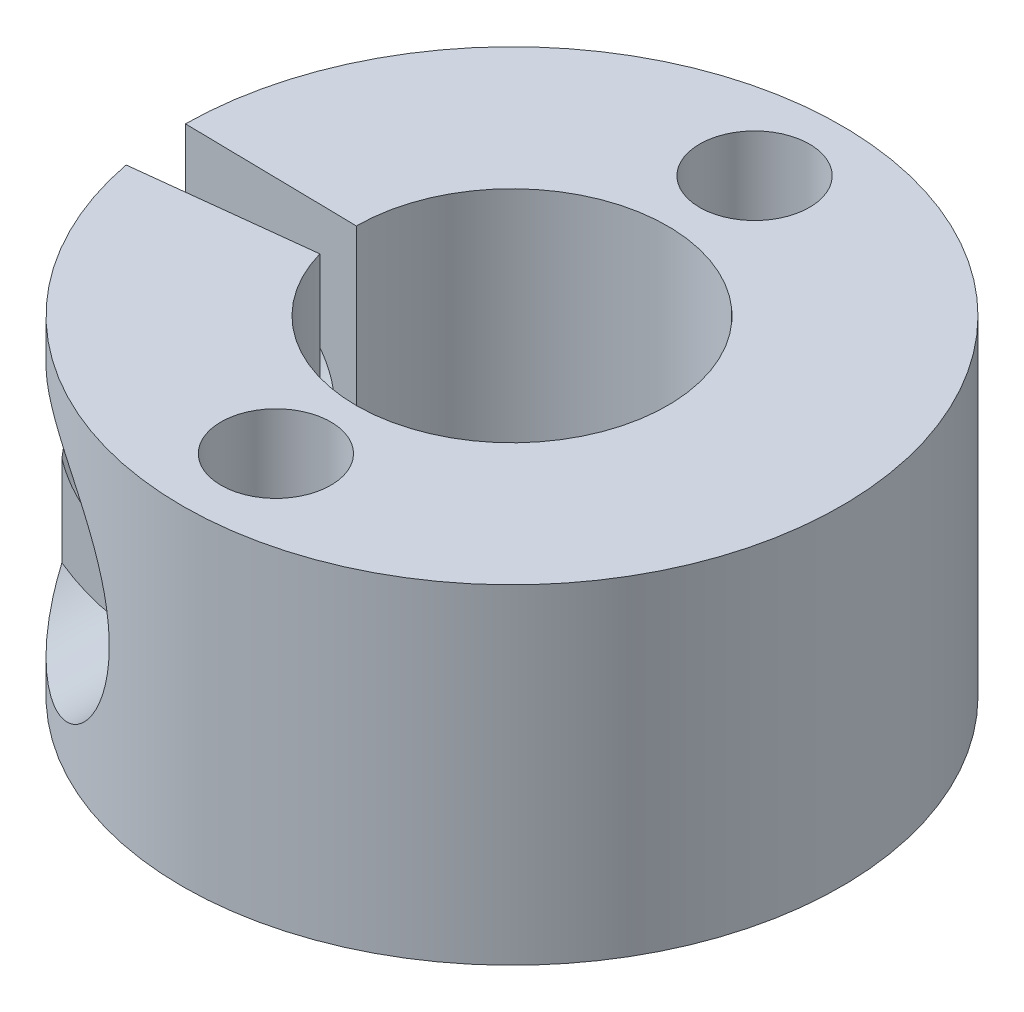
ISO-10303-21;
HEADER;
FILE_DESCRIPTION(('STEP AP214'),'2;1');
FILE_NAME('part.step','',(''),(''),'','','');
FILE_SCHEMA(('AUTOMOTIVE_DESIGN { 1 0 10303 214 1 1 1 1 }'));
ENDSEC;
DATA;
#1=APPLICATION_CONTEXT('core data for automotive mechanical design processes');
#2=APPLICATION_PROTOCOL_DEFINITION('international standard','automotive_design',2000,#1);
#3=PRODUCT_CONTEXT('',#1,'mechanical');
#4=PRODUCT('Part','Part','',(#3));
#5=PRODUCT_RELATED_PRODUCT_CATEGORY('part','',(#4));
#6=PRODUCT_DEFINITION_FORMATION('','',#4);
#7=PRODUCT_DEFINITION_CONTEXT('part definition',#1,'design');
#8=PRODUCT_DEFINITION('design','',#6,#7);
#9=PRODUCT_DEFINITION_SHAPE('','',#8);
#10=(LENGTH_UNIT() NAMED_UNIT(*) SI_UNIT(.MILLI.,.METRE.));
#11=(NAMED_UNIT(*) PLANE_ANGLE_UNIT() SI_UNIT($,.RADIAN.));
#12=(NAMED_UNIT(*) SI_UNIT($,.STERADIAN.) SOLID_ANGLE_UNIT());
#13=UNCERTAINTY_MEASURE_WITH_UNIT(LENGTH_MEASURE(1.E-05),#10,'distance_accuracy_value','');
#14=(GEOMETRIC_REPRESENTATION_CONTEXT(3) GLOBAL_UNCERTAINTY_ASSIGNED_CONTEXT((#13)) GLOBAL_UNIT_ASSIGNED_CONTEXT((#10,
#11,#12)) REPRESENTATION_CONTEXT('',''));
#15=CARTESIAN_POINT('',(0.,0.,0.));
#16=DIRECTION('',(0.,0.,1.));
#17=DIRECTION('',(1.,0.,0.));
#18=AXIS2_PLACEMENT_3D('',#15,#16,#17);
#19=CARTESIAN_POINT('',(0.,9.,0.));
#20=DIRECTION('',(0.,-1.,0.));
#21=DIRECTION('',(0.,0.,-1.));
#22=AXIS2_PLACEMENT_3D('',#19,#20,#21);
#23=CYLINDRICAL_SURFACE('',#22,9.);
#24=CARTESIAN_POINT('',(0.,0.,0.));
#25=DIRECTION('',(0.,1.,0.));
#26=DIRECTION('',(0.,0.,1.));
#27=AXIS2_PLACEMENT_3D('',#24,#25,#26);
#28=CIRCLE('',#27,9.);
#29=CARTESIAN_POINT('',(-8.83748475087481,0.,1.70260485082567));
#30=VERTEX_POINT('',#29);
#31=CARTESIAN_POINT('',(-8.9996340101143,0.,-0.0811645488748965));
#32=VERTEX_POINT('',#31);
#33=EDGE_CURVE('E187',#30,#32,#28,.T.);
#34=ORIENTED_EDGE('',*,*,#33,.T.);
#35=DIRECTION('',(0.,-1.,0.));
#36=VECTOR('',#35,1.);
#37=CARTESIAN_POINT('',(-8.9996340101143,9.,-0.0811645488748965));
#38=LINE('',#37,#36);
#39=CARTESIAN_POINT('',(-8.9996340101143,9.,-0.0811645488748965));
#40=VERTEX_POINT('',#39);
#41=EDGE_CURVE('E190',#40,#32,#38,.T.);
#42=ORIENTED_EDGE('',*,*,#41,.F.);
#43=CARTESIAN_POINT('',(0.,9.,0.));
#44=DIRECTION('',(0.,1.,0.));
#45=DIRECTION('',(0.,0.,1.));
#46=AXIS2_PLACEMENT_3D('',#43,#44,#45);
#47=CIRCLE('',#46,9.);
#48=CARTESIAN_POINT('',(-8.83748475087481,9.,1.70260485082567));
#49=VERTEX_POINT('',#48);
#50=EDGE_CURVE('E267',#49,#40,#47,.T.);
#51=ORIENTED_EDGE('',*,*,#50,.F.);
#52=DIRECTION('',(0.,-1.,0.));
#53=VECTOR('',#52,1.);
#54=CARTESIAN_POINT('',(-8.83748475087481,9.,1.70260485082567));
#55=LINE('',#54,#53);
#56=EDGE_CURVE('E193',#49,#30,#55,.T.);
#57=ORIENTED_EDGE('',*,*,#56,.T.);
#58=EDGE_LOOP('',(#34,#42,#51,#57));
#59=FACE_BOUND('',#58,.T.);
#60=CARTESIAN_POINT('',(-8.48528137423857,7.76050900908432,-3.));
#61=CARTESIAN_POINT('',(-8.44495085436606,7.77552774353456,-3.11406620598194));
#62=CARTESIAN_POINT('',(-8.40232890570056,7.79056011930466,-3.22730517801149));
#63=CARTESIAN_POINT('',(-8.31252283997298,7.82010782212848,-3.45204592248437));
#64=CARTESIAN_POINT('',(-8.26533809067395,7.83462307714581,-3.56354745168921));
#65=CARTESIAN_POINT('',(-8.11667535571836,7.8766585906456,-3.89597465868536));
#66=CARTESIAN_POINT('',(-8.00834450725121,7.90256655423747,-4.11409938980698));
#67=CARTESIAN_POINT('',(-7.77223990357658,7.94559907706022,-4.54460538819213));
#68=CARTESIAN_POINT('',(-7.64420964717245,7.96259237415407,-4.75685946451119));
#69=CARTESIAN_POINT('',(-7.37082189985997,7.98167891841669,-5.1703167838034));
#70=CARTESIAN_POINT('',(-7.22549532254726,7.98379835462839,-5.37153883098005));
#71=CARTESIAN_POINT('',(-6.99107700774978,7.97096663733869,-5.66940653848536));
#72=CARTESIAN_POINT('',(-6.9075828527267,7.96355644094522,-5.77083169523526));
#73=CARTESIAN_POINT('',(-6.73660170505478,7.94181441923973,-5.96953575010602));
#74=CARTESIAN_POINT('',(-6.64911455620681,7.92748232294427,-6.06681448573759));
#75=CARTESIAN_POINT('',(-6.47119033429151,7.89096520962642,-6.25623708188801));
#76=CARTESIAN_POINT('',(-6.38076936725079,7.86881807063564,-6.34840327160613));
#77=CARTESIAN_POINT('',(-6.1974001410065,7.8156579775667,-6.52752977521101));
#78=CARTESIAN_POINT('',(-6.10445233971756,7.78464662030376,-6.61449102331551));
#79=CARTESIAN_POINT('',(-5.93235977982098,7.71867465021353,-6.76891551983107));
#80=CARTESIAN_POINT('',(-5.85343252324547,7.68517988905159,-6.83724761209439));
#81=CARTESIAN_POINT('',(-5.69533786780611,7.61084639150834,-6.96948634121759));
#82=CARTESIAN_POINT('',(-5.61617052419272,7.57000923486361,-7.03339392593388));
#83=CARTESIAN_POINT('',(-5.45841362384296,7.48056311442633,-7.15651748881545));
#84=CARTESIAN_POINT('',(-5.37982470670777,7.43194660143283,-7.21572882533164));
#85=CARTESIAN_POINT('',(-5.2243788933401,7.32675697547519,-7.32905945130294));
#86=CARTESIAN_POINT('',(-5.14752112891834,7.27018795871256,-7.38318133844591));
#87=CARTESIAN_POINT('',(-4.99601538025349,7.14851803738301,-7.48654184841081));
#88=CARTESIAN_POINT('',(-4.92139036080846,7.08335168546059,-7.53573732761078));
#89=CARTESIAN_POINT('',(-4.77625996801831,6.9450217128066,-7.62854894319543));
#90=CARTESIAN_POINT('',(-4.70575259816238,6.87186201801987,-7.67216779590766));
#91=CARTESIAN_POINT('',(-4.57005191136833,6.71789641066687,-7.75376655827919));
#92=CARTESIAN_POINT('',(-4.50485736773976,6.6370922725074,-7.791747771299));
#93=CARTESIAN_POINT('',(-4.38093449302082,6.46839607891945,-7.86209210937738));
#94=CARTESIAN_POINT('',(-4.32220521541787,6.38050506427978,-7.89445605720262));
#95=CARTESIAN_POINT('',(-4.21968241762702,6.21067446871052,-7.94966669072841));
#96=CARTESIAN_POINT('',(-4.17494270732046,6.12952926871871,-7.97320819724951));
#97=CARTESIAN_POINT('',(-4.09167527752173,5.96304876280742,-8.01625793189216));
#98=CARTESIAN_POINT('',(-4.05314955652308,5.87771212033499,-8.035764863013));
#99=CARTESIAN_POINT('',(-3.98286540361003,5.70357093471373,-8.07083203464564));
#100=CARTESIAN_POINT('',(-3.95110275672877,5.61476859258234,-8.08639473448788));
#101=CARTESIAN_POINT('',(-3.89471738377346,5.43434464665925,-8.11370113920768));
#102=CARTESIAN_POINT('',(-3.87009724522031,5.34272203442906,-8.12544346026093));
#103=CARTESIAN_POINT('',(-3.80979635864988,5.07502432040511,-8.15398352265292));
#104=CARTESIAN_POINT('',(-3.78368695491389,4.89615381016597,-8.16602124772313));
#105=CARTESIAN_POINT('',(-3.75939542802626,4.53623880715111,-8.17723143362739));
#106=CARTESIAN_POINT('',(-3.76120995978847,4.35519457736761,-8.17640543544261));
#107=CARTESIAN_POINT('',(-3.79249740810287,3.99762123162599,-8.16193919117866));
#108=CARTESIAN_POINT('',(-3.82172715036719,3.82106642003753,-8.14841160765284));
#109=CARTESIAN_POINT('',(-3.9062231457925,3.47587817590336,-8.1082419309699));
#110=CARTESIAN_POINT('',(-3.96148761548656,3.30724420162356,-8.08160073613392));
#111=CARTESIAN_POINT('',(-4.09566897615604,2.98226945716512,-8.01443068616515));
#112=CARTESIAN_POINT('',(-4.17462832427247,2.82595139514342,-7.97387688319665));
#113=CARTESIAN_POINT('',(-4.35243957015082,2.5300263174567,-7.87822433807494));
#114=CARTESIAN_POINT('',(-4.45129016368968,2.39041820711535,-7.8231265494635));
#115=CARTESIAN_POINT('',(-4.66628028338768,2.12837303641028,-7.696857759943));
#116=CARTESIAN_POINT('',(-4.78271912557023,2.00632351001146,-7.6253945209473));
#117=CARTESIAN_POINT('',(-5.02591991348596,1.78436929611965,-7.46733883758155));
#118=CARTESIAN_POINT('',(-5.15268536282909,1.68447216763666,-7.38074124692108));
#119=CARTESIAN_POINT('',(-5.4208917261024,1.50023416694324,-7.18633146815537));
#120=CARTESIAN_POINT('',(-5.56271824190028,1.41763586357273,-7.07741156919859));
#121=CARTESIAN_POINT('',(-5.84625107484483,1.27655207148461,-6.8450673471161));
#122=CARTESIAN_POINT('',(-5.98795740671867,1.21806300220696,-6.7216451812821));
#123=CARTESIAN_POINT('',(-6.23415613296246,1.13355882336459,-6.49281234773772));
#124=CARTESIAN_POINT('',(-6.33958272953894,1.10314489887149,-6.38996499882014));
#125=CARTESIAN_POINT('',(-6.54650789028692,1.0532405683839,-6.17779806903204));
#126=CARTESIAN_POINT('',(-6.64800463142953,1.03375517684359,-6.06847554248106));
#127=CARTESIAN_POINT('',(-6.84653901303269,1.00412517291623,-5.84358946116857));
#128=CARTESIAN_POINT('',(-6.94354872561294,0.994033093606812,-5.72799458795582));
#129=CARTESIAN_POINT('',(-7.13182854502237,0.981854283545501,-5.4917984002698));
#130=CARTESIAN_POINT('',(-7.22309685650145,0.979770044745155,-5.37119553916565));
#131=CARTESIAN_POINT('',(-7.43634583048147,0.982670764166359,-5.07412581364632));
#132=CARTESIAN_POINT('',(-7.5551739446038,0.990983216202296,-4.89542298475872));
#133=CARTESIAN_POINT('',(-7.77954855309545,1.01703917731253,-4.53040780160647));
#134=CARTESIAN_POINT('',(-7.88508382053643,1.03479059319499,-4.34408918874066));
#135=CARTESIAN_POINT('',(-8.08092616043629,1.07596181707774,-3.96774183050624));
#136=CARTESIAN_POINT('',(-8.17143335254537,1.09929493802,-3.77780718277034));
#137=CARTESIAN_POINT('',(-8.33867420567828,1.14871507756984,-3.39271222465989));
#138=CARTESIAN_POINT('',(-8.41543191688156,1.17479715825434,-3.19756173884412));
#139=CARTESIAN_POINT('',(-8.48528137423857,1.20078069501616,-3.));
#140=B_SPLINE_CURVE_WITH_KNOTS('',3,(#60,#61,#62,#63,#64,#65,#66,#67,#68,#69,#70,#71,#72,#73,
#74,#75,#76,#77,#78,#79,#80,#81,#82,#83,#84,#85,#86,#87,#88,#89,#90,#91,#92,#93,#94,#95,#96,#97,
#98,#99,#100,#101,#102,#103,#104,#105,#106,#107,#108,#109,#110,#111,#112,#113,#114,#115,#116,
#117,#118,#119,#120,#121,#122,#123,#124,#125,#126,#127,#128,#129,#130,#131,#132,#133,#134,#135,
#136,#137,#138,#139),.UNSPECIFIED.,.F.,.F.,(4,2,2,2,2,2,2,2,2,2,2,2,2,2,2,2,2,2,2,2,2,2,2,2,2,2,
2,2,2,2,2,2,2,2,2,2,2,2,2,4),(0.,0.36569058140676,0.731431906931589,1.46523015797174,
2.20954957533893,2.95255810811937,3.34704421602945,3.74154576881271,4.13416093242777,
4.52670541421074,4.8553159137001,5.18385579615831,5.51271645388802,5.84140833744946,
6.17276480749072,6.50395925664295,6.8350770176093,7.16614623840947,7.45259548172945,
7.73913666765717,8.0254987457134,8.31196443515979,8.85262830395767,9.39322740562628,
9.92907626380394,10.4648884198583,11.0016664505743,11.5384092974551,12.0856094324419,
12.6329960008857,13.2216858286224,13.8102881961199,14.2608633180634,14.7116450133645,
15.1649328653771,15.6183617641445,16.2617562430167,16.9056905300362,17.5402083227634,
18.1736051612125),.UNSPECIFIED.);
#141=CARTESIAN_POINT('',(-8.48528137423857,7.76050900908432,-3.));
#142=VERTEX_POINT('',#141);
#143=CARTESIAN_POINT('',(-8.48528137423857,1.20078069501616,-3.));
#144=VERTEX_POINT('',#143);
#145=EDGE_CURVE('E11',#142,#144,#140,.T.);
#146=ORIENTED_EDGE('',*,*,#145,.F.);
#147=DIRECTION('',(0.,-1.,0.));
#148=VECTOR('',#147,1.);
#149=CARTESIAN_POINT('',(-8.48528137423857,9.,-3.));
#150=LINE('',#149,#148);
#151=CARTESIAN_POINT('',(-8.48528137423859,5.39168457568224,-3.));
#152=VERTEX_POINT('',#151);
#153=EDGE_CURVE('E112',#142,#152,#150,.T.);
#154=ORIENTED_EDGE('',*,*,#153,.T.);
#155=CARTESIAN_POINT('',(-8.66586820163894,4.5,-2.42955310948804));
#156=CARTESIAN_POINT('',(-8.66586831719192,4.45732564077833,-2.42955270839625));
#157=CARTESIAN_POINT('',(-8.66473980716112,4.41465232748748,-2.43358854369098));
#158=CARTESIAN_POINT('',(-8.66036359991175,4.33077680705108,-2.44911479758704));
#159=CARTESIAN_POINT('',(-8.65711198203749,4.28957747059902,-2.46061900750141));
#160=CARTESIAN_POINT('',(-8.64755706042879,4.19766009364114,-2.49401987976736));
#161=CARTESIAN_POINT('',(-8.64063195829821,4.14777979902994,-2.51799553145866));
#162=CARTESIAN_POINT('',(-8.62441993734724,4.05250132589371,-2.57297520541116));
#163=CARTESIAN_POINT('',(-8.61512714330768,4.00711469279438,-2.60399669019047));
#164=CARTESIAN_POINT('',(-8.59548175053052,3.92386511372849,-2.66809478823471));
#165=CARTESIAN_POINT('',(-8.58526959958859,3.88569124390298,-2.70081894309502));
#166=CARTESIAN_POINT('',(-8.56349290759348,3.81235369390698,-2.76909371541047));
#167=CARTESIAN_POINT('',(-8.55192716789751,3.77719273020582,-2.80464682893795));
#168=CARTESIAN_POINT('',(-8.51539442085208,3.67546869820093,-2.91444337228253));
#169=CARTESIAN_POINT('',(-8.48862915098184,3.61281338546117,-2.99169989945343));
#170=CARTESIAN_POINT('',(-8.42961575415651,3.49281086527218,-3.15427516023178));
#171=CARTESIAN_POINT('',(-8.39716776685175,3.43585644633409,-3.23980249253979));
#172=CARTESIAN_POINT('',(-8.32798736455081,3.32921625805376,-3.41370679523509));
#173=CARTESIAN_POINT('',(-8.29125090160522,3.27953745760665,-3.5020864000618));
#174=CARTESIAN_POINT('',(-8.21358791981962,3.18668970150562,-3.68055207849543));
#175=CARTESIAN_POINT('',(-8.17265612653341,3.14352911345091,-3.77064018122897));
#176=CARTESIAN_POINT('',(-8.08668695136189,3.06349701554486,-3.95164980804409));
#177=CARTESIAN_POINT('',(-8.04164929390721,3.02662592829748,-4.04257138769644));
#178=CARTESIAN_POINT('',(-7.94370831123679,2.95649579510328,-4.23199265557245));
#179=CARTESIAN_POINT('',(-7.89046363636327,2.92376674327607,-4.3305129717875));
#180=CARTESIAN_POINT('',(-7.77927161161196,2.86606846134414,-4.52721796004265));
#181=CARTESIAN_POINT('',(-7.72132301369281,2.84110129916052,-4.62540253575601));
#182=CARTESIAN_POINT('',(-7.60100285288928,2.79965828234204,-4.82056645288469));
#183=CARTESIAN_POINT('',(-7.53864142450502,2.78316364647596,-4.91754799094151));
#184=CARTESIAN_POINT('',(-7.40969926176543,2.75952947851131,-5.10977023092143));
#185=CARTESIAN_POINT('',(-7.34312072458751,2.75238511613443,-5.20501180660063));
#186=CARTESIAN_POINT('',(-7.18318896571052,2.74798370885632,-5.42456109624416));
#187=CARTESIAN_POINT('',(-7.08834048827377,2.75484273710775,-5.5479126352273));
#188=CARTESIAN_POINT('',(-6.89401916069482,2.79078653406566,-5.7875899500383));
#189=CARTESIAN_POINT('',(-6.794551944777,2.8198448586172,-5.90392390755137));
#190=CARTESIAN_POINT('',(-6.61595387905255,2.89502103723636,-6.10271183169264));
#191=CARTESIAN_POINT('',(-6.53696714104357,2.93623654909765,-6.18713045386012));
#192=CARTESIAN_POINT('',(-6.38150318795718,3.0364380887073,-6.34734697835669));
#193=CARTESIAN_POINT('',(-6.30502291426145,3.09540148977036,-6.42315568891605));
#194=CARTESIAN_POINT('',(-6.17194789325222,3.21944972218645,-6.55087691449805));
#195=CARTESIAN_POINT('',(-6.11426723547634,3.28146761746124,-6.6046274852947));
#196=CARTESIAN_POINT('',(-6.00597342012721,3.41765128660301,-6.70325613509628));
#197=CARTESIAN_POINT('',(-5.95535834895991,3.49181375944696,-6.74813661778836));
#198=CARTESIAN_POINT('',(-5.8637962629674,3.65160539822792,-6.82785633581274));
#199=CARTESIAN_POINT('',(-5.82291479578892,3.73730654041058,-6.86262782367239));
#200=CARTESIAN_POINT('',(-5.75405865234159,3.91743072375432,-6.92046637728492));
#201=CARTESIAN_POINT('',(-5.72607650239917,4.01184867636382,-6.94354022125461));
#202=CARTESIAN_POINT('',(-5.68750743263101,4.19461115793937,-6.97515625874043));
#203=CARTESIAN_POINT('',(-5.67526603071002,4.28237040522234,-6.98508472363571));
#204=CARTESIAN_POINT('',(-5.66321159354071,4.4592802998842,-6.99486252928352));
#205=CARTESIAN_POINT('',(-5.66339307978421,4.54843031659061,-6.99471631298205));
#206=CARTESIAN_POINT('',(-5.6757728093422,4.71987475502779,-6.9846727431666));
#207=CARTESIAN_POINT('',(-5.6872451614842,4.80225821050694,-6.97536441864787));
#208=CARTESIAN_POINT('',(-5.72049797147643,4.9634194696515,-6.94811922004275));
#209=CARTESIAN_POINT('',(-5.74227778174177,5.04219749949341,-6.93018288802554));
#210=CARTESIAN_POINT('',(-5.79537920198232,5.19526032813641,-6.88583937964196));
#211=CARTESIAN_POINT('',(-5.82683185857364,5.2694654799311,-6.85931558327047));
#212=CARTESIAN_POINT('',(-5.89760123495451,5.41058393876759,-6.79856377801549));
#213=CARTESIAN_POINT('',(-5.93691965306947,5.47749566623106,-6.76433410512757));
#214=CARTESIAN_POINT('',(-6.02509126334836,5.60804459719243,-6.68595634427571));
#215=CARTESIAN_POINT('',(-6.07445635904938,5.67098831740368,-6.64123281198734));
#216=CARTESIAN_POINT('',(-6.1781697219499,5.78658797241871,-6.54486418975799));
#217=CARTESIAN_POINT('',(-6.23252081247778,5.83923802492251,-6.49321517051103));
#218=CARTESIAN_POINT('',(-6.36712793911941,5.95366997595685,-6.36173813380184));
#219=CARTESIAN_POINT('',(-6.44888935019474,6.01038339187032,-6.27902317012768));
#220=CARTESIAN_POINT('',(-6.61407316569784,6.10463125931174,-6.10479734896119));
#221=CARTESIAN_POINT('',(-6.69749839930864,6.14212951849473,-6.01327027578333));
#222=CARTESIAN_POINT('',(-6.89162575040107,6.20997781368287,-5.79086257472046));
#223=CARTESIAN_POINT('',(-7.00174134605156,6.23332530146665,-5.65735203959063));
#224=CARTESIAN_POINT('',(-7.21487040289262,6.25404670220963,-5.38293558338917));
#225=CARTESIAN_POINT('',(-7.3178735068284,6.25138350938297,-5.24201938260246));
#226=CARTESIAN_POINT('',(-7.48356999695432,6.22870608837865,-5.00103712024407));
#227=CARTESIAN_POINT('',(-7.54875197556276,6.21441276155997,-4.90206321261668));
#228=CARTESIAN_POINT('',(-7.6744549867758,6.17674035134797,-4.70282979946794));
#229=CARTESIAN_POINT('',(-7.73497394973364,6.15335726104504,-4.60256974586733));
#230=CARTESIAN_POINT('',(-7.85125203399344,6.09825037978806,-4.40129385183284));
#231=CARTESIAN_POINT('',(-7.90700024879072,6.06650811992278,-4.30027682512378));
#232=CARTESIAN_POINT('',(-8.01349185228748,5.99520591764341,-4.09840945708009));
#233=CARTESIAN_POINT('',(-8.06423693442209,5.95564863413102,-3.99755907078475));
#234=CARTESIAN_POINT('',(-8.15056485765694,5.8779442650411,-3.81785814731217));
#235=CARTESIAN_POINT('',(-8.18709465794716,5.84124366708141,-3.73883267148464));
#236=CARTESIAN_POINT('',(-8.25698063340629,5.76288221681613,-3.58184952465772));
#237=CARTESIAN_POINT('',(-8.29033734437329,5.72122220462628,-3.5038916752921));
#238=CARTESIAN_POINT('',(-8.35367933537165,5.63273849239449,-3.35006403701444));
#239=CARTESIAN_POINT('',(-8.38367906921026,5.58593879655373,-3.27418644952028));
#240=CARTESIAN_POINT('',(-8.4403316925981,5.48630359183891,-3.12524023763062));
#241=CARTESIAN_POINT('',(-8.4669877017405,5.43347379810658,-3.0521690398007));
#242=CARTESIAN_POINT('',(-8.50998512253676,5.33567488681254,-2.9297033633898));
#243=CARTESIAN_POINT('',(-8.52716962921023,5.29242769458396,-2.87923773161539));
#244=CARTESIAN_POINT('',(-8.55943312977046,5.20105730419367,-2.7818581107636));
#245=CARTESIAN_POINT('',(-8.57450675699864,5.15292219593746,-2.7349533083459));
#246=CARTESIAN_POINT('',(-8.60228227969731,5.05011184246616,-2.6463029182926));
#247=CARTESIAN_POINT('',(-8.61494726441576,4.99535307755905,-2.60464049625196));
#248=CARTESIAN_POINT('',(-8.63677645223606,4.87887518199266,-2.53131402241449));
#249=CARTESIAN_POINT('',(-8.64595885784445,4.81719448868181,-2.49959813784755));
#250=CARTESIAN_POINT('',(-8.65697675793533,4.71203356534561,-2.46109691664881));
#251=CARTESIAN_POINT('',(-8.66027799437853,4.67053268667903,-2.44941807238862));
#252=CARTESIAN_POINT('',(-8.66472157993321,4.58601880162417,-2.4336536798352));
#253=CARTESIAN_POINT('',(-8.66586808518019,4.54300886961583,-2.42955351372386));
#254=CARTESIAN_POINT('',(-8.66586820163894,4.5,-2.42955310948804));
#255=B_SPLINE_CURVE_WITH_KNOTS('',3,(#155,#156,#157,#158,#159,#160,#161,#162,#163,#164,#165,
#166,#167,#168,#169,#170,#171,#172,#173,#174,#175,#176,#177,#178,#179,#180,#181,#182,#183,#184,
#185,#186,#187,#188,#189,#190,#191,#192,#193,#194,#195,#196,#197,#198,#199,#200,#201,#202,#203,
#204,#205,#206,#207,#208,#209,#210,#211,#212,#213,#214,#215,#216,#217,#218,#219,#220,#221,#222,
#223,#224,#225,#226,#227,#228,#229,#230,#231,#232,#233,#234,#235,#236,#237,#238,#239,#240,#241,
#242,#243,#244,#245,#246,#247,#248,#249,#250,#251,#252,#253,#254),.UNSPECIFIED.,.T.,.F.,(4,2,2,
2,2,2,2,2,2,2,2,2,2,2,2,2,2,2,2,2,2,2,2,2,2,2,2,2,2,2,2,2,2,2,2,2,2,2,2,2,2,2,2,2,2,2,2,2,2,4),
(0.,0.127834771606463,0.255906280619685,0.422276054196688,0.589062750171576,0.742757444953081,
0.896589285659057,1.20483946498097,1.52771201531623,1.85089183189491,2.17448305934291,
2.4980960209668,2.84776968517588,3.19753642969504,3.5465244559244,3.89533212640874,
4.36103899102022,4.82619196155912,5.19305372496007,5.55944974521865,5.8591652487603,
6.15879942130756,6.46039765837896,6.76182093358863,7.0279140779135,7.29388987560734,
7.54381361660633,7.79372165777372,8.04717684554929,8.30068681694219,8.57453711067103,
8.84854344122505,9.2345864959925,9.6213540265663,10.1424113341586,10.6642120694987,
11.021890466182,11.3797267122075,11.7383603000848,12.0968720797122,12.3801399526692,
12.6633599086631,12.9453092620279,13.2269935772324,13.4327183982592,13.6389571063944,
13.8481385945659,14.0562111646398,14.1852972345198,14.314134061239),.UNSPECIFIED.);
#256=CARTESIAN_POINT('',(-8.48528137423857,3.60831542431809,-3.));
#257=VERTEX_POINT('',#256);
#258=EDGE_CURVE('E129',#152,#257,#255,.T.);
#259=ORIENTED_EDGE('',*,*,#258,.T.);
#260=EDGE_CURVE('E63',#257,#144,#150,.T.);
#261=ORIENTED_EDGE('',*,*,#260,.T.);
#262=EDGE_LOOP('',(#146,#154,#259,#261));
#263=FACE_BOUND('',#262,.T.);
#264=DIRECTION('',(0.,-1.,0.));
#265=VECTOR('',#264,1.);
#266=CARTESIAN_POINT('',(-7.79422863405995,9.,4.5));
#267=LINE('',#266,#265);
#268=CARTESIAN_POINT('',(-7.79422863405995,7.2601017550627,4.5));
#269=VERTEX_POINT('',#268);
#270=CARTESIAN_POINT('',(-7.79422863405995,5.01958866003821,4.5));
#271=VERTEX_POINT('',#270);
#272=EDGE_CURVE('E71',#269,#271,#267,.T.);
#273=ORIENTED_EDGE('',*,*,#272,.F.);
#274=CARTESIAN_POINT('',(-7.79422863405995,7.2601017550627,4.5));
#275=CARTESIAN_POINT('',(-7.69267669209293,7.33056875490452,4.67589129259055));
#276=CARTESIAN_POINT('',(-7.58450664933302,7.39770242486797,4.84949691842253));
#277=CARTESIAN_POINT('',(-7.35444288151857,7.52275498673687,5.19180715789457));
#278=CARTESIAN_POINT('',(-7.23250056758877,7.58063939643359,5.36049159928942));
#279=CARTESIAN_POINT('',(-6.97355819684809,7.68472831149229,5.69337201234899));
#280=CARTESIAN_POINT('',(-6.83639109588785,7.73078008951998,5.85748705300204));
#281=CARTESIAN_POINT('',(-6.54879549819022,7.80676525453545,6.17732828406531));
#282=CARTESIAN_POINT('',(-6.39838944250334,7.83672532836384,6.33306797583835));
#283=CARTESIAN_POINT('',(-6.15209068827556,7.86818735420652,6.57018641977648));
#284=CARTESIAN_POINT('',(-6.06028654816204,7.8763760735049,6.6549671133656));
#285=CARTESIAN_POINT('',(-5.87302945225324,7.88538810097023,6.82078775401055));
#286=CARTESIAN_POINT('',(-5.77757770418614,7.88621382617473,6.90182891994346));
#287=CARTESIAN_POINT('',(-5.58383815957348,7.87968729466178,7.05948297131941));
#288=CARTESIAN_POINT('',(-5.48556030489658,7.87236093582213,7.13610907140216));
#289=CARTESIAN_POINT('',(-5.28663592744354,7.84876201096448,7.28470187458252));
#290=CARTESIAN_POINT('',(-5.18599057333276,7.83249377374822,7.35667081340383));
#291=CARTESIAN_POINT('',(-4.98192213791178,7.78998197299682,7.49639464194066));
#292=CARTESIAN_POINT('',(-4.8784800191058,7.7636146260199,7.56408458177394));
#293=CARTESIAN_POINT('',(-4.67125940069585,7.70024533789281,7.69378148834772));
#294=CARTESIAN_POINT('',(-4.56748089138007,7.66324308695318,7.7557882894718));
#295=CARTESIAN_POINT('',(-4.36104174870623,7.5781253541259,7.87371853147091));
#296=CARTESIAN_POINT('',(-4.25838087852365,7.53001227655085,7.92964328461702));
#297=CARTESIAN_POINT('',(-4.05578200430332,7.42244037989085,8.03515222180112));
#298=CARTESIAN_POINT('',(-3.95584341972092,7.36298400182946,8.0847377661791));
#299=CARTESIAN_POINT('',(-3.77509015164887,7.24259144757131,8.17050523993544));
#300=CARTESIAN_POINT('',(-3.6936564333429,7.18321666718231,8.20758191016611));
#301=CARTESIAN_POINT('',(-3.53507129296709,7.05657582243709,8.27712298447387));
#302=CARTESIAN_POINT('',(-3.45791933997124,6.98931073968966,8.30958796116915));
#303=CARTESIAN_POINT('',(-3.30896291802547,6.84731711731284,8.37001948337641));
#304=CARTESIAN_POINT('',(-3.2371564239526,6.7725914295058,8.39798773717373));
#305=CARTESIAN_POINT('',(-3.09982806843372,6.61620851860985,8.44964199359629));
#306=CARTESIAN_POINT('',(-3.03430578557081,6.53455176100914,8.47332828346284));
#307=CARTESIAN_POINT('',(-2.91712410762021,6.37417419604523,8.51432994397803));
#308=CARTESIAN_POINT('',(-2.86473184646809,6.2960923089414,8.53205739891023));
#309=CARTESIAN_POINT('',(-2.76615098450003,6.13547997485129,8.56452584294118));
#310=CARTESIAN_POINT('',(-2.71996432534644,6.05294814679532,8.57926589804655));
#311=CARTESIAN_POINT('',(-2.63429707831912,5.88409229898433,8.60595696535711));
#312=CARTESIAN_POINT('',(-2.59481298285334,5.79777029266503,8.61790943759497));
#313=CARTESIAN_POINT('',(-2.52288825298245,5.62192231400103,8.63923789486528));
#314=CARTESIAN_POINT('',(-2.49045023534603,5.53239516566105,8.64861292303014));
#315=CARTESIAN_POINT('',(-2.40498513959861,5.26244550697309,8.67292414402704));
#316=CARTESIAN_POINT('',(-2.36256758414713,5.07820791948319,8.68441581643077));
#317=CARTESIAN_POINT('',(-2.30795464402484,4.70508036362411,8.69908849517433));
#318=CARTESIAN_POINT('',(-2.29576069488568,4.51619017470049,8.70226910676381));
#319=CARTESIAN_POINT('',(-2.30197533098756,4.13760175621261,8.70062787946356));
#320=CARTESIAN_POINT('',(-2.32059761231085,3.94790705944498,8.69575016022315));
#321=CARTESIAN_POINT('',(-2.38823549850624,3.57444512596439,8.67741566431995));
#322=CARTESIAN_POINT('',(-2.43725110909562,3.39067789036646,8.66395888604334));
#323=CARTESIAN_POINT('',(-2.56393617846286,3.03434871261366,8.62731422274762));
#324=CARTESIAN_POINT('',(-2.6416015623613,2.86178518105002,8.60412772153004));
#325=CARTESIAN_POINT('',(-2.82265948580716,2.53282746211949,8.54643644443823));
#326=CARTESIAN_POINT('',(-2.92604810578479,2.37643081646298,8.51193339266506));
#327=CARTESIAN_POINT('',(-3.15357784469606,2.08517074176236,8.43026687193844));
#328=CARTESIAN_POINT('',(-3.27756597906798,1.95016193720681,8.38319528571298));
#329=CARTESIAN_POINT('',(-3.54163332147065,1.70356738553689,8.27509156817378));
#330=CARTESIAN_POINT('',(-3.68171135011072,1.59197992332912,8.21406045976958));
#331=CARTESIAN_POINT('',(-3.97374523087278,1.39289648683827,8.0768568468021));
#332=CARTESIAN_POINT('',(-4.12581300121613,1.30567364562266,8.00052797063511));
#333=CARTESIAN_POINT('',(-4.43458179194716,1.15701453295436,7.83360102322319));
#334=CARTESIAN_POINT('',(-4.59128413760235,1.09558571518859,7.74299883781349));
#335=CARTESIAN_POINT('',(-4.91670890363932,0.993167677327058,7.54092358532772));
#336=CARTESIAN_POINT('',(-5.08538608115371,0.954215910885898,7.42835878594276));
#337=CARTESIAN_POINT('',(-5.41717002559901,0.901694214182921,7.1899966367881));
#338=CARTESIAN_POINT('',(-5.5802745779686,0.888134262048646,7.06419410553752));
#339=CARTESIAN_POINT('',(-5.86103642987947,0.883356680840679,6.83179814554215));
#340=CARTESIAN_POINT('',(-5.98052220391163,0.88771972972739,6.72743656075507));
#341=CARTESIAN_POINT('',(-6.21335777207861,0.907652507579396,6.51300493962717));
#342=CARTESIAN_POINT('',(-6.32670455339105,0.923227686465316,6.40293215137405));
#343=CARTESIAN_POINT('',(-6.54695479224378,0.964076203438437,6.17756447658794));
#344=CARTESIAN_POINT('',(-6.65383589079478,0.989381191210376,6.06225364236273));
#345=CARTESIAN_POINT('',(-6.86040856778634,1.0482190775317,5.82745605606479));
#346=CARTESIAN_POINT('',(-6.96010174798397,1.08175013560409,5.70797024321079));
#347=CARTESIAN_POINT('',(-7.19478787669465,1.17211748812553,5.41155350277303));
#348=CARTESIAN_POINT('',(-7.32583340883345,1.23269508380491,5.23264210759458));
#349=CARTESIAN_POINT('',(-7.5717335920271,1.36425795859683,4.86995658731925));
#350=CARTESIAN_POINT('',(-7.68671231500335,1.43515372548518,4.68623443225896));
#351=CARTESIAN_POINT('',(-7.79422863405995,1.50975714597162,4.5));
#352=B_SPLINE_CURVE_WITH_KNOTS('',3,(#274,#275,#276,#277,#278,#279,#280,#281,#282,#283,#284,
#285,#286,#287,#288,#289,#290,#291,#292,#293,#294,#295,#296,#297,#298,#299,#300,#301,#302,#303,
#304,#305,#306,#307,#308,#309,#310,#311,#312,#313,#314,#315,#316,#317,#318,#319,#320,#321,#322,
#323,#324,#325,#326,#327,#328,#329,#330,#331,#332,#333,#334,#335,#336,#337,#338,#339,#340,#341,
#342,#343,#344,#345,#346,#347,#348,#349,#350,#351),.UNSPECIFIED.,.F.,.F.,(4,2,2,2,2,2,2,2,2,2,2,
2,2,2,2,2,2,2,2,2,2,2,2,2,2,2,2,2,2,2,2,2,2,2,2,2,2,2,4),(0.,0.645049506783027,1.29245037875515,
1.94782945615075,2.60211825572757,2.97753650256174,3.35283150694805,3.72693765398805,
4.10086285394041,4.47952598254397,4.85820014253467,5.23679243648972,5.61530335091798,
5.93700515645921,6.25866698240804,6.58020632021985,6.90172408062387,7.18844020677107,
7.47524583525498,7.76190090651524,8.04866225425978,8.61398790024928,9.17934039701547,
9.7486298002163,10.3179193105062,10.8871278815086,11.4562497726,12.0213198859828,
12.5863486060763,13.1574781318826,13.7287725833329,14.3459430239059,14.9633559408147,
15.4388440336261,15.9145634048503,16.3918434968427,16.8690169008106,17.5577626980891,
18.2408549817688),.UNSPECIFIED.);
#353=CARTESIAN_POINT('',(-7.79422863405995,1.50975714597162,4.5));
#354=VERTEX_POINT('',#353);
#355=EDGE_CURVE('E231',#269,#354,#352,.T.);
#356=ORIENTED_EDGE('',*,*,#355,.T.);
#357=CARTESIAN_POINT('',(-7.79422863405995,3.9804113399618,4.5));
#358=VERTEX_POINT('',#357);
#359=EDGE_CURVE('E135',#358,#354,#267,.T.);
#360=ORIENTED_EDGE('',*,*,#359,.F.);
#361=CARTESIAN_POINT('',(-7.8939232987976,4.5,4.32272772132371));
#362=CARTESIAN_POINT('',(-7.89392350189436,4.54267435922167,4.3227273566611));
#363=CARTESIAN_POINT('',(-7.8919132330674,4.58534767251252,4.32640435552691));
#364=CARTESIAN_POINT('',(-7.88414570914233,4.66922319294892,4.34054229462735));
#365=CARTESIAN_POINT('',(-7.87838152188897,4.71042252940098,4.35101578544285));
#366=CARTESIAN_POINT('',(-7.86153465407372,4.80233990635886,4.38139831068172));
#367=CARTESIAN_POINT('',(-7.84937699676493,4.85222020097006,4.40319235303975));
#368=CARTESIAN_POINT('',(-7.82117452189978,4.94749867410629,4.45309440292467));
#369=CARTESIAN_POINT('',(-7.80512003947621,4.99288530720562,4.48121809637141));
#370=CARTESIAN_POINT('',(-7.7715147785796,5.07613488627151,4.53922838916784));
#371=CARTESIAN_POINT('',(-7.75418037291131,5.11430875609702,4.5688033231206));
#372=CARTESIAN_POINT('',(-7.71755614151429,5.18764630609302,4.63040149292745));
#373=CARTESIAN_POINT('',(-7.69826458471393,5.22280726979418,4.66242688991845));
#374=CARTESIAN_POINT('',(-7.63789368935989,5.32453130179907,4.76114506216275));
#375=CARTESIAN_POINT('',(-7.59438244000553,5.38718661453883,4.83036732622106));
#376=CARTESIAN_POINT('',(-7.50019893739392,5.50718913472782,4.97542856934898));
#377=CARTESIAN_POINT('',(-7.44928490052126,5.56414355366591,5.05142565680096));
#378=CARTESIAN_POINT('',(-7.34263979246345,5.67078374194624,5.20522895808478));
#379=CARTESIAN_POINT('',(-7.28690418319031,5.72046254239335,5.28303682476951));
#380=CARTESIAN_POINT('',(-7.17096587734341,5.81331029849438,5.43936931133566));
#381=CARTESIAN_POINT('',(-7.11075758444904,5.85647088654909,5.51789471755876));
#382=CARTESIAN_POINT('',(-6.98615324365001,5.93650298445515,5.67483082663967));
#383=CARTESIAN_POINT('',(-6.92175691474418,5.97337407170253,5.75324152143914));
#384=CARTESIAN_POINT('',(-6.78359118447547,6.04350420489673,5.91567022515101));
#385=CARTESIAN_POINT('',(-6.70948458545555,6.07623325672394,5.99963128809807));
#386=CARTESIAN_POINT('',(-6.5567658072909,6.13393153865586,6.16616504914565));
#387=CARTESIAN_POINT('',(-6.47815243404813,6.15889870083948,6.24873737172532));
#388=CARTESIAN_POINT('',(-6.31688886441065,6.20034171765797,6.41170962934169));
#389=CARTESIAN_POINT('',(-6.23424804524428,6.21683635352404,6.4921139916705));
#390=CARTESIAN_POINT('',(-6.06524887173564,6.24047052148869,6.6502745121181));
#391=CARTESIAN_POINT('',(-5.97889246067364,6.24761488386557,6.72803201734493));
#392=CARTESIAN_POINT('',(-5.77353565902074,6.25201629114368,6.90582021182183));
#393=CARTESIAN_POINT('',(-5.65329440019503,6.24515726289226,7.0045819226089));
#394=CARTESIAN_POINT('',(-5.40989252623572,6.20921346593434,7.19421715493705));
#395=CARTESIAN_POINT('',(-5.28673555336486,6.1801551413828,7.28509991868454));
#396=CARTESIAN_POINT('',(-5.06787986723756,6.10497896276364,7.43844950790687));
#397=CARTESIAN_POINT('',(-4.9718781298433,6.06376345090235,7.50286282149371));
#398=CARTESIAN_POINT('',(-4.78426509931031,5.9635619112927,7.62385755776449));
#399=CARTESIAN_POINT('',(-4.69264838708475,5.90459851022963,7.68044881947711));
#400=CARTESIAN_POINT('',(-4.53418069948277,5.78055027781354,7.77483983953123));
#401=CARTESIAN_POINT('',(-4.46585698861611,5.71853238253876,7.81418514008712));
#402=CARTESIAN_POINT('',(-4.33809720534186,5.58234871339699,7.88582729794317));
#403=CARTESIAN_POINT('',(-4.27865872621004,5.50818624055304,7.91812606501623));
#404=CARTESIAN_POINT('',(-4.17146664662803,5.34839460177207,7.97512349573087));
#405=CARTESIAN_POINT('',(-4.1237921929527,5.26269345958941,7.99977095388376));
#406=CARTESIAN_POINT('',(-4.04365870540251,5.08256927624567,8.0405764798266));
#407=CARTESIAN_POINT('',(-4.01119086086835,4.98815132363618,8.05673946415016));
#408=CARTESIAN_POINT('',(-3.96648131559985,4.80538884206063,8.07883479241134));
#409=CARTESIAN_POINT('',(-3.95231494485266,4.71762959477766,8.08574422625365));
#410=CARTESIAN_POINT('',(-3.93836471808266,4.54071970011579,8.09254908568062));
#411=CARTESIAN_POINT('',(-3.93857452215002,4.45156968340939,8.09244760308744));
#412=CARTESIAN_POINT('',(-3.95290163020374,4.2801252449722,8.0854572544993));
#413=CARTESIAN_POINT('',(-3.9661788305779,4.19774178949305,8.07897838737299));
#414=CARTESIAN_POINT('',(-4.00472280238058,4.03658053034849,8.05994125373669));
#415=CARTESIAN_POINT('',(-4.02998882058996,3.95780250050658,8.04738336915094));
#416=CARTESIAN_POINT('',(-4.09172830104941,3.80473967186359,8.01616888341235));
#417=CARTESIAN_POINT('',(-4.12835574940447,3.7305345200689,7.99742824821485));
#418=CARTESIAN_POINT('',(-4.21101061673183,3.58941606123241,7.95421645142078));
#419=CARTESIAN_POINT('',(-4.2570400657698,3.52250433376894,7.92974405206278));
#420=CARTESIAN_POINT('',(-4.3606262763369,3.39195540280757,7.87328873135982));
#421=CARTESIAN_POINT('',(-4.41881160924035,3.32901168259631,7.84086074886268));
#422=CARTESIAN_POINT('',(-4.54159904514158,3.21341202758129,7.77038650832532));
#423=CARTESIAN_POINT('',(-4.60620478545257,3.16076197507749,7.73233705958278));
#424=CARTESIAN_POINT('',(-4.76701272299377,3.04633002404315,7.6346329299449));
#425=CARTESIAN_POINT('',(-4.86533302872955,2.98961660812967,7.57250555243169));
#426=CARTESIAN_POINT('',(-5.06557698538071,2.89536874068826,7.4400567416028));
#427=CARTESIAN_POINT('',(-5.16750705231579,2.85787048150527,7.36972014954623));
#428=CARTESIAN_POINT('',(-5.40682224935523,2.79002218631713,7.1968651513535));
#429=CARTESIAN_POINT('',(-5.544229554386,2.76667469853335,7.09165231981525));
#430=CARTESIAN_POINT('',(-5.81379440176651,2.74595329779037,6.87241915772326));
#431=CARTESIAN_POINT('',(-5.94594417420891,2.74861649061704,6.75838647509242));
#432=CARTESIAN_POINT('',(-6.1617543269605,2.77129391162135,6.56101941709957));
#433=CARTESIAN_POINT('',(-6.24759259150326,2.78558723844003,6.47931068398839));
#434=CARTESIAN_POINT('',(-6.41501859475803,2.82325964865203,6.31358882852854));
#435=CARTESIAN_POINT('',(-6.49660444092541,2.84664273895496,6.22957470512871));
#436=CARTESIAN_POINT('',(-6.65530968659916,2.90174962021195,6.05973588920565));
#437=CARTESIAN_POINT('',(-6.73241872875533,2.93349188007722,5.97390757944728));
#438=CARTESIAN_POINT('',(-6.88172350367813,3.00479408235659,5.801283768571));
#439=CARTESIAN_POINT('',(-6.9539208963325,3.04435136586898,5.71448860585626));
#440=CARTESIAN_POINT('',(-7.07857935775373,3.12205573495891,5.55890840074317));
#441=CARTESIAN_POINT('',(-7.13200243495673,3.15875633291859,5.49016665970344));
#442=CARTESIAN_POINT('',(-7.23551585109631,3.23711778318387,5.35300715171121));
#443=CARTESIAN_POINT('',(-7.28560675226282,3.27877779537373,5.28458933192297));
#444=CARTESIAN_POINT('',(-7.3820328454456,3.36726150760551,5.14902695264602));
#445=CARTESIAN_POINT('',(-7.42838387844347,3.41406120344627,5.08187805798384));
#446=CARTESIAN_POINT('',(-7.51719148174368,3.5136964081611,4.94956137963574));
#447=CARTESIAN_POINT('',(-7.55965167196306,3.56652620189342,4.88439179300031));
#448=CARTESIAN_POINT('',(-7.62917982552436,3.66432511318747,4.77479044284318));
#449=CARTESIAN_POINT('',(-7.65731088630918,3.70757230541605,4.72950544887032));
#450=CARTESIAN_POINT('',(-7.71072022640494,3.79894269580634,4.64192025368201));
#451=CARTESIAN_POINT('',(-7.73599120412618,3.84707780406254,4.59962779084678));
#452=CARTESIAN_POINT('',(-7.78305820353637,3.94988815753384,4.51953366569201));
#453=CARTESIAN_POINT('',(-7.80479949661211,4.00464692244095,4.48180469242734));
#454=CARTESIAN_POINT('',(-7.84261502479746,4.12112481800734,4.41529701592009));
#455=CARTESIAN_POINT('',(-7.85871869126021,4.18280551131819,4.38647192558065));
#456=CARTESIAN_POINT('',(-7.87814192409697,4.28796643465439,4.35145084361027));
#457=CARTESIAN_POINT('',(-7.88399386413849,4.32946731332097,4.34081842323398));
#458=CARTESIAN_POINT('',(-7.8918807750949,4.41398119837583,4.32646369715768));
#459=CARTESIAN_POINT('',(-7.89392309410883,4.45699113038417,4.3227280888448));
#460=CARTESIAN_POINT('',(-7.8939232987976,4.5,4.32272772132371));
#461=B_SPLINE_CURVE_WITH_KNOTS('',3,(#361,#362,#363,#364,#365,#366,#367,#368,#369,#370,#371,
#372,#373,#374,#375,#376,#377,#378,#379,#380,#381,#382,#383,#384,#385,#386,#387,#388,#389,#390,
#391,#392,#393,#394,#395,#396,#397,#398,#399,#400,#401,#402,#403,#404,#405,#406,#407,#408,#409,
#410,#411,#412,#413,#414,#415,#416,#417,#418,#419,#420,#421,#422,#423,#424,#425,#426,#427,#428,
#429,#430,#431,#432,#433,#434,#435,#436,#437,#438,#439,#440,#441,#442,#443,#444,#445,#446,#447,
#448,#449,#450,#451,#452,#453,#454,#455,#456,#457,#458,#459,#460),.UNSPECIFIED.,.T.,.F.,(4,2,2,
2,2,2,2,2,2,2,2,2,2,2,2,2,2,2,2,2,2,2,2,2,2,2,2,2,2,2,2,2,2,2,2,2,2,2,2,2,2,2,2,2,2,2,2,2,2,4),
(0.,0.127834771606462,0.255906280619685,0.422276054196688,0.589062750171574,0.742757444953079,
0.896589285659054,1.20483946498097,1.52771201531623,1.8508918318949,2.17448305934291,
2.4980960209668,2.84776968517588,3.19753642969505,3.54652445592441,3.89533212640875,
4.36103899102023,4.82619196155913,5.19305372496008,5.55944974521866,5.85916524876031,
6.15879942130757,6.46039765837897,6.76182093358864,7.02791407791351,7.29388987560735,
7.54381361660634,7.79372165777372,8.04717684554929,8.3006868169422,8.57453711067104,
8.84854344122506,9.23458649599251,9.62135402656631,10.1424113341586,10.6642120694987,
11.021890466182,11.3797267122075,11.7383603000848,12.0968720797122,12.3801399526692,
12.6633599086631,12.9453092620279,13.2269935772324,13.4327183982593,13.6389571063944,
13.8481385945659,14.0562111646398,14.1852972345199,14.314134061239),.UNSPECIFIED.);
#462=EDGE_CURVE('E144',#358,#271,#461,.T.);
#463=ORIENTED_EDGE('',*,*,#462,.T.);
#464=EDGE_LOOP('',(#273,#356,#360,#463));
#465=FACE_BOUND('',#464,.T.);
#466=ADVANCED_FACE('F41',(#59,#263,#465),#23,.T.);
#467=CARTESIAN_POINT('',(-5.40947170487256,4.5,10.6473423594077));
#468=DIRECTION('',(-0.113583724543793,0.,-0.993528428138199));
#469=DIRECTION('',(-0.993528428138199,0.,0.113583724543793));
#470=AXIS2_PLACEMENT_3D('',#467,#468,#469);
#471=CYLINDRICAL_SURFACE('',#470,1.75);
#472=CARTESIAN_POINT('',(-6.46309903667431,4.5,1.43115658091773));
#473=DIRECTION('',(0.113583724543793,0.,0.993528428138199));
#474=DIRECTION('',(0.993528428138199,0.,-0.113583724543793));
#475=AXIS2_PLACEMENT_3D('',#472,#473,#474);
#476=CIRCLE('',#475,1.75);
#477=CARTESIAN_POINT('',(-4.72442428743246,4.5,1.23238506296609));
#478=VERTEX_POINT('',#477);
#479=EDGE_CURVE('E258',#478,#478,#476,.T.);
#480=ORIENTED_EDGE('',*,*,#479,.F.);
#481=EDGE_LOOP('',(#480));
#482=FACE_BOUND('',#481,.T.);
#483=CARTESIAN_POINT('',(-6.11225787731839,4.5,4.5));
#484=DIRECTION('',(0.,0.,1.));
#485=DIRECTION('',(-1.,0.,0.));
#486=AXIS2_PLACEMENT_3D('',#483,#484,#485);
#487=ELLIPSE('',#486,1.76139902033742,1.75);
#488=EDGE_CURVE('E226',#271,#358,#487,.F.);
#489=ORIENTED_EDGE('',*,*,#488,.F.);
#490=ORIENTED_EDGE('',*,*,#462,.F.);
#491=EDGE_LOOP('',(#489,#490));
#492=FACE_BOUND('',#491,.T.);
#493=ADVANCED_FACE('F152',(#482,#492),#471,.F.);
#494=CARTESIAN_POINT('',(0.,9.,0.));
#495=DIRECTION('',(0.,-1.,0.));
#496=DIRECTION('',(0.,0.,-1.));
#497=AXIS2_PLACEMENT_3D('',#494,#495,#496);
#498=CYLINDRICAL_SURFACE('',#497,4.25);
#499=CARTESIAN_POINT('',(0.,0.,0.));
#500=DIRECTION('',(0.,1.,0.));
#501=DIRECTION('',(0.,0.,1.));
#502=AXIS2_PLACEMENT_3D('',#499,#500,#501);
#503=CIRCLE('',#502,4.25);
#504=CARTESIAN_POINT('',(-4.08871332247381,0.,1.15970831100979));
#505=VERTEX_POINT('',#504);
#506=CARTESIAN_POINT('',(-4.25,0.,0.));
#507=VERTEX_POINT('',#506);
#508=EDGE_CURVE('E209',#505,#507,#503,.T.);
#509=ORIENTED_EDGE('',*,*,#508,.F.);
#510=DIRECTION('',(0.,-1.,0.));
#511=VECTOR('',#510,1.);
#512=CARTESIAN_POINT('',(-4.08871332247381,9.,1.15970831100979));
#513=LINE('',#512,#511);
#514=CARTESIAN_POINT('',(-4.08871332247381,9.,1.15970831100979));
#515=VERTEX_POINT('',#514);
#516=EDGE_CURVE('E223',#515,#505,#513,.T.);
#517=ORIENTED_EDGE('',*,*,#516,.F.);
#518=CARTESIAN_POINT('',(0.,9.,0.));
#519=DIRECTION('',(0.,1.,0.));
#520=DIRECTION('',(0.,0.,1.));
#521=AXIS2_PLACEMENT_3D('',#518,#519,#520);
#522=CIRCLE('',#521,4.25);
#523=CARTESIAN_POINT('',(-4.25,9.,0.));
#524=VERTEX_POINT('',#523);
#525=EDGE_CURVE('E211',#515,#524,#522,.T.);
#526=ORIENTED_EDGE('',*,*,#525,.T.);
#527=DIRECTION('',(0.,-1.,0.));
#528=VECTOR('',#527,1.);
#529=CARTESIAN_POINT('',(-4.25,9.,0.));
#530=LINE('',#529,#528);
#531=EDGE_CURVE('E206',#524,#507,#530,.T.);
#532=ORIENTED_EDGE('',*,*,#531,.T.);
#533=EDGE_LOOP('',(#509,#517,#526,#532));
#534=FACE_BOUND('',#533,.T.);
#535=ADVANCED_FACE('F43',(#534),#498,.F.);
#536=CARTESIAN_POINT('',(0.0781219643021104,9.,0.683340792951532));
#537=DIRECTION('',(0.113583724543793,0.,0.993528428138199));
#538=DIRECTION('',(0.993528428138199,0.,-0.113583724543793));
#539=AXIS2_PLACEMENT_3D('',#536,#537,#538);
#540=PLANE('',#539);
#541=ORIENTED_EDGE('',*,*,#479,.T.);
#542=EDGE_LOOP('',(#541));
#543=FACE_BOUND('',#542,.T.);
#544=DIRECTION('',(-0.993528428138199,0.,0.113583724543793));
#545=VECTOR('',#544,1.);
#546=CARTESIAN_POINT('',(0.0781219643021104,0.,0.683340792951532));
#547=LINE('',#546,#545);
#548=EDGE_CURVE('E199',#505,#30,#547,.T.);
#549=ORIENTED_EDGE('',*,*,#548,.T.);
#550=ORIENTED_EDGE('',*,*,#56,.F.);
#551=DIRECTION('',(-0.993528428138199,0.,0.113583724543793));
#552=VECTOR('',#551,1.);
#553=CARTESIAN_POINT('',(0.0781219643021104,9.,0.683340792951532));
#554=LINE('',#553,#552);
#555=EDGE_CURVE('E215',#515,#49,#554,.T.);
#556=ORIENTED_EDGE('',*,*,#555,.F.);
#557=ORIENTED_EDGE('',*,*,#516,.T.);
#558=EDGE_LOOP('',(#549,#550,#556,#557));
#559=FACE_BOUND('',#558,.T.);
#560=ADVANCED_FACE('F172',(#543,#559),#540,.F.);
#561=CARTESIAN_POINT('',(-0.00124072231332203,9.,0.0726053058650664));
#562=DIRECTION('',(0.0170860955738321,0.,-0.999854022014235));
#563=DIRECTION('',(-0.999854022014235,0.,-0.0170860955738321));
#564=AXIS2_PLACEMENT_3D('',#561,#562,#563);
#565=PLANE('',#564);
#566=CARTESIAN_POINT('',(-6.63136628305333,4.5,-0.0406941923647864));
#567=DIRECTION('',(0.0170860955738321,0.,-0.999854022014235));
#568=DIRECTION('',(-0.999854022014235,0.,-0.0170860955738321));
#569=AXIS2_PLACEMENT_3D('',#566,#567,#568);
#570=ELLIPSE('',#569,1.76510454236288,1.75);
#571=CARTESIAN_POINT('',(-8.39621315901045,4.5,-0.0708529372734037));
#572=VERTEX_POINT('',#571);
#573=EDGE_CURVE('E145',#572,#572,#570,.T.);
#574=ORIENTED_EDGE('',*,*,#573,.T.);
#575=EDGE_LOOP('',(#574));
#576=FACE_BOUND('',#575,.T.);
#577=DIRECTION('',(0.999854022014235,0.,0.0170860955738321));
#578=VECTOR('',#577,1.);
#579=CARTESIAN_POINT('',(-0.00124072231332203,0.,0.0726053058650664));
#580=LINE('',#579,#578);
#581=EDGE_CURVE('E198',#32,#507,#580,.T.);
#582=ORIENTED_EDGE('',*,*,#581,.T.);
#583=ORIENTED_EDGE('',*,*,#531,.F.);
#584=DIRECTION('',(0.999854022014235,0.,0.0170860955738321));
#585=VECTOR('',#584,1.);
#586=CARTESIAN_POINT('',(-0.00124072231332203,9.,0.0726053058650664));
#587=LINE('',#586,#585);
#588=EDGE_CURVE('E204',#40,#524,#587,.T.);
#589=ORIENTED_EDGE('',*,*,#588,.F.);
#590=ORIENTED_EDGE('',*,*,#41,.T.);
#591=EDGE_LOOP('',(#582,#583,#589,#590));
#592=FACE_BOUND('',#591,.T.);
#593=ADVANCED_FACE('F167',(#576,#592),#565,.F.);
#594=CARTESIAN_POINT('',(0.,9.,0.));
#595=DIRECTION('',(0.,1.,0.));
#596=DIRECTION('',(0.,0.,1.));
#597=AXIS2_PLACEMENT_3D('',#594,#595,#596);
#598=PLANE('',#597);
#599=CARTESIAN_POINT('',(0.0355056644796292,9.,6.48423345853377));
#600=DIRECTION('',(0.,1.,0.));
#601=DIRECTION('',(0.,0.,1.));
#602=AXIS2_PLACEMENT_3D('',#599,#600,#601);
#603=CIRCLE('',#602,1.5);
#604=CARTESIAN_POINT('',(0.0355056644796292,9.,7.98423345853377));
#605=VERTEX_POINT('',#604);
#606=EDGE_CURVE('E367',#605,#605,#603,.T.);
#607=ORIENTED_EDGE('',*,*,#606,.F.);
#608=EDGE_LOOP('',(#607));
#609=FACE_BOUND('',#608,.T.);
#610=CARTESIAN_POINT('',(0.,9.,-6.625));
#611=DIRECTION('',(0.,1.,0.));
#612=DIRECTION('',(0.,0.,1.));
#613=AXIS2_PLACEMENT_3D('',#610,#611,#612);
#614=CIRCLE('',#613,1.5);
#615=CARTESIAN_POINT('',(0.,9.,-5.125));
#616=VERTEX_POINT('',#615);
#617=EDGE_CURVE('E375',#616,#616,#614,.T.);
#618=ORIENTED_EDGE('',*,*,#617,.F.);
#619=EDGE_LOOP('',(#618));
#620=FACE_BOUND('',#619,.T.);
#621=ORIENTED_EDGE('',*,*,#525,.F.);
#622=ORIENTED_EDGE('',*,*,#555,.T.);
#623=ORIENTED_EDGE('',*,*,#50,.T.);
#624=ORIENTED_EDGE('',*,*,#588,.T.);
#625=EDGE_LOOP('',(#621,#622,#623,#624));
#626=FACE_BOUND('',#625,.T.);
#627=ADVANCED_FACE('F162',(#609,#620,#626),#598,.T.);
#628=CARTESIAN_POINT('',(0.,0.,0.));
#629=DIRECTION('',(0.,1.,0.));
#630=DIRECTION('',(0.,0.,1.));
#631=AXIS2_PLACEMENT_3D('',#628,#629,#630);
#632=PLANE('',#631);
#633=CARTESIAN_POINT('',(0.0355056644796292,0.,6.48423345853377));
#634=DIRECTION('',(0.,1.,0.));
#635=DIRECTION('',(0.,0.,1.));
#636=AXIS2_PLACEMENT_3D('',#633,#634,#635);
#637=CIRCLE('',#636,1.5);
#638=CARTESIAN_POINT('',(0.0355056644796292,0.,7.98423345853377));
#639=VERTEX_POINT('',#638);
#640=EDGE_CURVE('E126',#639,#639,#637,.T.);
#641=ORIENTED_EDGE('',*,*,#640,.T.);
#642=EDGE_LOOP('',(#641));
#643=FACE_BOUND('',#642,.T.);
#644=CARTESIAN_POINT('',(0.,0.,-6.625));
#645=DIRECTION('',(0.,1.,0.));
#646=DIRECTION('',(0.,0.,1.));
#647=AXIS2_PLACEMENT_3D('',#644,#645,#646);
#648=CIRCLE('',#647,1.5);
#649=CARTESIAN_POINT('',(0.,0.,-5.125));
#650=VERTEX_POINT('',#649);
#651=EDGE_CURVE('E369',#650,#650,#648,.T.);
#652=ORIENTED_EDGE('',*,*,#651,.T.);
#653=EDGE_LOOP('',(#652));
#654=FACE_BOUND('',#653,.T.);
#655=ORIENTED_EDGE('',*,*,#508,.T.);
#656=ORIENTED_EDGE('',*,*,#581,.F.);
#657=ORIENTED_EDGE('',*,*,#33,.F.);
#658=ORIENTED_EDGE('',*,*,#548,.F.);
#659=EDGE_LOOP('',(#655,#656,#657,#658));
#660=FACE_BOUND('',#659,.T.);
#661=ADVANCED_FACE('F166',(#643,#654,#660),#632,.F.);
#662=ORIENTED_EDGE('',*,*,#573,.F.);
#663=EDGE_LOOP('',(#662));
#664=FACE_BOUND('',#663,.T.);
#665=ORIENTED_EDGE('',*,*,#258,.F.);
#666=CARTESIAN_POINT('',(-6.96968471076573,4.5,-3.));
#667=DIRECTION('',(0.,0.,1.));
#668=DIRECTION('',(-1.,0.,0.));
#669=AXIS2_PLACEMENT_3D('',#666,#667,#668);
#670=ELLIPSE('',#669,1.76139902033742,1.75);
#671=EDGE_CURVE('E56',#152,#257,#670,.F.);
#672=ORIENTED_EDGE('',*,*,#671,.T.);
#673=EDGE_LOOP('',(#665,#672));
#674=FACE_BOUND('',#673,.T.);
#675=ADVANCED_FACE('F158',(#664,#674),#471,.F.);
#676=CARTESIAN_POINT('',(-5.79838690206458,4.38492945051716,4.5));
#677=DIRECTION('',(0.,0.,1.));
#678=DIRECTION('',(1.,0.,0.));
#679=AXIS2_PLACEMENT_3D('',#676,#677,#678);
#680=CYLINDRICAL_SURFACE('',#679,3.5);
#681=CARTESIAN_POINT('',(-5.79838690206458,4.38492945051716,4.5));
#682=DIRECTION('',(0.,0.,1.));
#683=DIRECTION('',(1.,0.,0.));
#684=AXIS2_PLACEMENT_3D('',#681,#682,#683);
#685=CIRCLE('',#684,3.5);
#686=EDGE_CURVE('E121',#354,#269,#685,.T.);
#687=ORIENTED_EDGE('',*,*,#686,.F.);
#688=ORIENTED_EDGE('',*,*,#355,.F.);
#689=EDGE_LOOP('',(#687,#688));
#690=FACE_BOUND('',#689,.T.);
#691=ADVANCED_FACE('F159',(#690),#680,.F.);
#692=CARTESIAN_POINT('',(-5.79838690206458,4.38492945051716,4.5));
#693=DIRECTION('',(0.,0.,1.));
#694=DIRECTION('',(1.,0.,0.));
#695=AXIS2_PLACEMENT_3D('',#692,#693,#694);
#696=PLANE('',#695);
#697=ORIENTED_EDGE('',*,*,#272,.T.);
#698=ORIENTED_EDGE('',*,*,#488,.T.);
#699=ORIENTED_EDGE('',*,*,#359,.T.);
#700=ORIENTED_EDGE('',*,*,#686,.T.);
#701=EDGE_LOOP('',(#697,#698,#699,#700));
#702=FACE_BOUND('',#701,.T.);
#703=ADVANCED_FACE('F245',(#702),#696,.T.);
#704=CARTESIAN_POINT('',(-7.26360583981744,4.48064485205024,-3.));
#705=DIRECTION('',(0.,0.,-1.));
#706=DIRECTION('',(-1.,0.,0.));
#707=AXIS2_PLACEMENT_3D('',#704,#705,#706);
#708=CYLINDRICAL_SURFACE('',#707,3.5);
#709=ORIENTED_EDGE('',*,*,#145,.T.);
#710=CARTESIAN_POINT('',(-7.26360583981744,4.48064485205024,-3.));
#711=DIRECTION('',(0.,0.,1.));
#712=DIRECTION('',(1.,0.,0.));
#713=AXIS2_PLACEMENT_3D('',#710,#711,#712);
#714=CIRCLE('',#713,3.5);
#715=EDGE_CURVE('E115',#144,#142,#714,.T.);
#716=ORIENTED_EDGE('',*,*,#715,.T.);
#717=EDGE_LOOP('',(#709,#716));
#718=FACE_BOUND('',#717,.T.);
#719=ADVANCED_FACE('F124',(#718),#708,.F.);
#720=CARTESIAN_POINT('',(-7.26360583981744,4.48064485205024,-3.));
#721=DIRECTION('',(0.,0.,1.));
#722=DIRECTION('',(1.,0.,0.));
#723=AXIS2_PLACEMENT_3D('',#720,#721,#722);
#724=PLANE('',#723);
#725=ORIENTED_EDGE('',*,*,#715,.F.);
#726=ORIENTED_EDGE('',*,*,#260,.F.);
#727=ORIENTED_EDGE('',*,*,#671,.F.);
#728=ORIENTED_EDGE('',*,*,#153,.F.);
#729=EDGE_LOOP('',(#725,#726,#727,#728));
#730=FACE_BOUND('',#729,.T.);
#731=ADVANCED_FACE('F114',(#730),#724,.F.);
#732=CARTESIAN_POINT('',(0.,0.,-6.625));
#733=DIRECTION('',(0.,1.,0.));
#734=DIRECTION('',(0.,0.,1.));
#735=AXIS2_PLACEMENT_3D('',#732,#733,#734);
#736=CYLINDRICAL_SURFACE('',#735,1.5);
#737=ORIENTED_EDGE('',*,*,#651,.F.);
#738=EDGE_LOOP('',(#737));
#739=FACE_BOUND('',#738,.T.);
#740=ORIENTED_EDGE('',*,*,#617,.T.);
#741=EDGE_LOOP('',(#740));
#742=FACE_BOUND('',#741,.T.);
#743=ADVANCED_FACE('F328',(#739,#742),#736,.F.);
#744=CARTESIAN_POINT('',(0.0355056644796292,0.,6.48423345853377));
#745=DIRECTION('',(0.,1.,0.));
#746=DIRECTION('',(0.,0.,1.));
#747=AXIS2_PLACEMENT_3D('',#744,#745,#746);
#748=CYLINDRICAL_SURFACE('',#747,1.5);
#749=ORIENTED_EDGE('',*,*,#640,.F.);
#750=EDGE_LOOP('',(#749));
#751=FACE_BOUND('',#750,.T.);
#752=ORIENTED_EDGE('',*,*,#606,.T.);
#753=EDGE_LOOP('',(#752));
#754=FACE_BOUND('',#753,.T.);
#755=ADVANCED_FACE('F347',(#751,#754),#748,.F.);
#756=CLOSED_SHELL('',(#466,#493,#535,#560,#593,#627,#661,#675,#691,#703,#719,#731,#743,#755));
#757=MANIFOLD_SOLID_BREP('B2',#756);
#758=ADVANCED_BREP_SHAPE_REPRESENTATION('',(#18,#757),#14);
#759=SHAPE_DEFINITION_REPRESENTATION(#9,#758);
ENDSEC;
END-ISO-10303-21;
